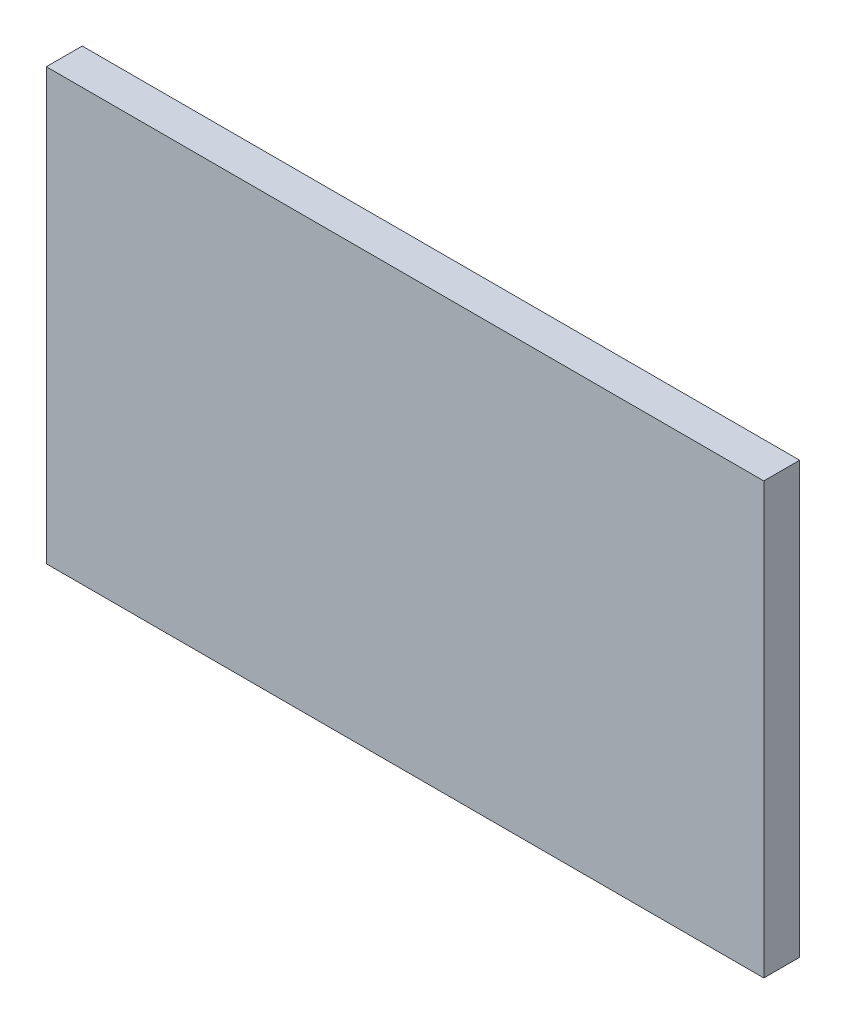
ISO-10303-21;
HEADER;
FILE_DESCRIPTION(('STEP AP214'),'2;1');
FILE_NAME('part.step','',(''),(''),'','','');
FILE_SCHEMA(('AUTOMOTIVE_DESIGN { 1 0 10303 214 1 1 1 1 }'));
ENDSEC;
DATA;
#1=APPLICATION_CONTEXT('core data for automotive mechanical design processes');
#2=APPLICATION_PROTOCOL_DEFINITION('international standard','automotive_design',2000,#1);
#3=PRODUCT_CONTEXT('',#1,'mechanical');
#4=PRODUCT('Part','Part','',(#3));
#5=PRODUCT_RELATED_PRODUCT_CATEGORY('part','',(#4));
#6=PRODUCT_DEFINITION_FORMATION('','',#4);
#7=PRODUCT_DEFINITION_CONTEXT('part definition',#1,'design');
#8=PRODUCT_DEFINITION('design','',#6,#7);
#9=PRODUCT_DEFINITION_SHAPE('','',#8);
#10=(LENGTH_UNIT() NAMED_UNIT(*) SI_UNIT(.MILLI.,.METRE.));
#11=(NAMED_UNIT(*) PLANE_ANGLE_UNIT() SI_UNIT($,.RADIAN.));
#12=(NAMED_UNIT(*) SI_UNIT($,.STERADIAN.) SOLID_ANGLE_UNIT());
#13=UNCERTAINTY_MEASURE_WITH_UNIT(LENGTH_MEASURE(1.E-05),#10,'distance_accuracy_value','');
#14=(GEOMETRIC_REPRESENTATION_CONTEXT(3) GLOBAL_UNCERTAINTY_ASSIGNED_CONTEXT((#13)) GLOBAL_UNIT_ASSIGNED_CONTEXT((#10,
#11,#12)) REPRESENTATION_CONTEXT('',''));
#15=CARTESIAN_POINT('',(0.,0.,0.));
#16=DIRECTION('',(0.,0.,1.));
#17=DIRECTION('',(1.,0.,0.));
#18=AXIS2_PLACEMENT_3D('',#15,#16,#17);
#19=CARTESIAN_POINT('',(1.01,-0.61,0.));
#20=DIRECTION('',(0.,0.,-1.));
#21=DIRECTION('',(-1.,0.,0.));
#22=AXIS2_PLACEMENT_3D('',#19,#20,#21);
#23=PLANE('',#22);
#24=DIRECTION('',(0.,-1.,0.));
#25=VECTOR('',#24,1.);
#26=CARTESIAN_POINT('',(-1.,0.,0.));
#27=LINE('',#26,#25);
#28=CARTESIAN_POINT('',(-1.,0.6,0.));
#29=VERTEX_POINT('',#28);
#30=CARTESIAN_POINT('',(-1.,-0.6,0.));
#31=VERTEX_POINT('',#30);
#32=EDGE_CURVE('E68',#29,#31,#27,.T.);
#33=ORIENTED_EDGE('',*,*,#32,.F.);
#34=DIRECTION('',(-1.,0.,0.));
#35=VECTOR('',#34,1.);
#36=CARTESIAN_POINT('',(0.,0.6,0.));
#37=LINE('',#36,#35);
#38=CARTESIAN_POINT('',(1.,0.6,0.));
#39=VERTEX_POINT('',#38);
#40=EDGE_CURVE('E55',#39,#29,#37,.T.);
#41=ORIENTED_EDGE('',*,*,#40,.F.);
#42=DIRECTION('',(0.,1.,0.));
#43=VECTOR('',#42,1.);
#44=CARTESIAN_POINT('',(1.,0.,0.));
#45=LINE('',#44,#43);
#46=CARTESIAN_POINT('',(1.,-0.6,0.));
#47=VERTEX_POINT('',#46);
#48=EDGE_CURVE('E20',#47,#39,#45,.T.);
#49=ORIENTED_EDGE('',*,*,#48,.F.);
#50=DIRECTION('',(1.,0.,0.));
#51=VECTOR('',#50,1.);
#52=CARTESIAN_POINT('',(0.,-0.6,0.));
#53=LINE('',#52,#51);
#54=EDGE_CURVE('E80',#31,#47,#53,.T.);
#55=ORIENTED_EDGE('',*,*,#54,.F.);
#56=EDGE_LOOP('',(#33,#41,#49,#55));
#57=FACE_BOUND('',#56,.T.);
#58=ADVANCED_FACE('F16',(#57),#23,.T.);
#59=CARTESIAN_POINT('',(1.,-0.61,0.11));
#60=DIRECTION('',(1.,0.,0.));
#61=DIRECTION('',(0.,0.,-1.));
#62=AXIS2_PLACEMENT_3D('',#59,#60,#61);
#63=PLANE('',#62);
#64=DIRECTION('',(0.,0.,-1.));
#65=VECTOR('',#64,1.);
#66=CARTESIAN_POINT('',(1.,0.6,0.05));
#67=LINE('',#66,#65);
#68=CARTESIAN_POINT('',(1.,0.6,0.1));
#69=VERTEX_POINT('',#68);
#70=EDGE_CURVE('E61',#69,#39,#67,.T.);
#71=ORIENTED_EDGE('',*,*,#70,.F.);
#72=DIRECTION('',(0.,1.,0.));
#73=VECTOR('',#72,1.);
#74=CARTESIAN_POINT('',(1.,0.,0.1));
#75=LINE('',#74,#73);
#76=CARTESIAN_POINT('',(1.,-0.6,0.1));
#77=VERTEX_POINT('',#76);
#78=EDGE_CURVE('E83',#77,#69,#75,.T.);
#79=ORIENTED_EDGE('',*,*,#78,.F.);
#80=DIRECTION('',(0.,0.,1.));
#81=VECTOR('',#80,1.);
#82=CARTESIAN_POINT('',(1.,-0.6,0.05));
#83=LINE('',#82,#81);
#84=EDGE_CURVE('E64',#47,#77,#83,.T.);
#85=ORIENTED_EDGE('',*,*,#84,.F.);
#86=ORIENTED_EDGE('',*,*,#48,.T.);
#87=EDGE_LOOP('',(#71,#79,#85,#86));
#88=FACE_BOUND('',#87,.T.);
#89=ADVANCED_FACE('F60',(#88),#63,.T.);
#90=CARTESIAN_POINT('',(-1.01,0.6,-0.01));
#91=DIRECTION('',(0.,1.,0.));
#92=DIRECTION('',(0.,0.,1.));
#93=AXIS2_PLACEMENT_3D('',#90,#91,#92);
#94=PLANE('',#93);
#95=DIRECTION('',(0.,0.,-1.));
#96=VECTOR('',#95,1.);
#97=CARTESIAN_POINT('',(-1.,0.6,0.05));
#98=LINE('',#97,#96);
#99=CARTESIAN_POINT('',(-1.,0.6,0.1));
#100=VERTEX_POINT('',#99);
#101=EDGE_CURVE('E70',#100,#29,#98,.T.);
#102=ORIENTED_EDGE('',*,*,#101,.F.);
#103=DIRECTION('',(-1.,0.,0.));
#104=VECTOR('',#103,1.);
#105=CARTESIAN_POINT('',(0.,0.6,0.1));
#106=LINE('',#105,#104);
#107=EDGE_CURVE('E74',#69,#100,#106,.T.);
#108=ORIENTED_EDGE('',*,*,#107,.F.);
#109=ORIENTED_EDGE('',*,*,#70,.T.);
#110=ORIENTED_EDGE('',*,*,#40,.T.);
#111=EDGE_LOOP('',(#102,#108,#109,#110));
#112=FACE_BOUND('',#111,.T.);
#113=ADVANCED_FACE('F72',(#112),#94,.T.);
#114=CARTESIAN_POINT('',(-1.,-0.61,-0.01));
#115=DIRECTION('',(-1.,0.,0.));
#116=DIRECTION('',(0.,0.,1.));
#117=AXIS2_PLACEMENT_3D('',#114,#115,#116);
#118=PLANE('',#117);
#119=DIRECTION('',(0.,0.,-1.));
#120=VECTOR('',#119,1.);
#121=CARTESIAN_POINT('',(-1.,-0.6,0.05));
#122=LINE('',#121,#120);
#123=CARTESIAN_POINT('',(-1.,-0.6,0.1));
#124=VERTEX_POINT('',#123);
#125=EDGE_CURVE('E35',#124,#31,#122,.T.);
#126=ORIENTED_EDGE('',*,*,#125,.F.);
#127=DIRECTION('',(0.,-1.,0.));
#128=VECTOR('',#127,1.);
#129=CARTESIAN_POINT('',(-1.,0.,0.1));
#130=LINE('',#129,#128);
#131=EDGE_CURVE('E26',#100,#124,#130,.T.);
#132=ORIENTED_EDGE('',*,*,#131,.F.);
#133=ORIENTED_EDGE('',*,*,#101,.T.);
#134=ORIENTED_EDGE('',*,*,#32,.T.);
#135=EDGE_LOOP('',(#126,#132,#133,#134));
#136=FACE_BOUND('',#135,.T.);
#137=ADVANCED_FACE('F88',(#136),#118,.T.);
#138=CARTESIAN_POINT('',(-1.01,-0.6,0.11));
#139=DIRECTION('',(0.,-1.,0.));
#140=DIRECTION('',(0.,0.,-1.));
#141=AXIS2_PLACEMENT_3D('',#138,#139,#140);
#142=PLANE('',#141);
#143=ORIENTED_EDGE('',*,*,#84,.T.);
#144=DIRECTION('',(1.,0.,0.));
#145=VECTOR('',#144,1.);
#146=CARTESIAN_POINT('',(0.,-0.6,0.1));
#147=LINE('',#146,#145);
#148=EDGE_CURVE('E11',#124,#77,#147,.T.);
#149=ORIENTED_EDGE('',*,*,#148,.F.);
#150=ORIENTED_EDGE('',*,*,#125,.T.);
#151=ORIENTED_EDGE('',*,*,#54,.T.);
#152=EDGE_LOOP('',(#143,#149,#150,#151));
#153=FACE_BOUND('',#152,.T.);
#154=ADVANCED_FACE('F90',(#153),#142,.T.);
#155=CARTESIAN_POINT('',(-1.01,-0.61,0.1));
#156=DIRECTION('',(0.,0.,1.));
#157=DIRECTION('',(1.,0.,0.));
#158=AXIS2_PLACEMENT_3D('',#155,#156,#157);
#159=PLANE('',#158);
#160=ORIENTED_EDGE('',*,*,#131,.T.);
#161=ORIENTED_EDGE('',*,*,#148,.T.);
#162=ORIENTED_EDGE('',*,*,#78,.T.);
#163=ORIENTED_EDGE('',*,*,#107,.T.);
#164=EDGE_LOOP('',(#160,#161,#162,#163));
#165=FACE_BOUND('',#164,.T.);
#166=ADVANCED_FACE('F18',(#165),#159,.T.);
#167=CLOSED_SHELL('',(#58,#89,#113,#137,#154,#166));
#168=MANIFOLD_SOLID_BREP('B1',#167);
#169=ADVANCED_BREP_SHAPE_REPRESENTATION('',(#18,#168),#14);
#170=SHAPE_DEFINITION_REPRESENTATION(#9,#169);
ENDSEC;
END-ISO-10303-21;
